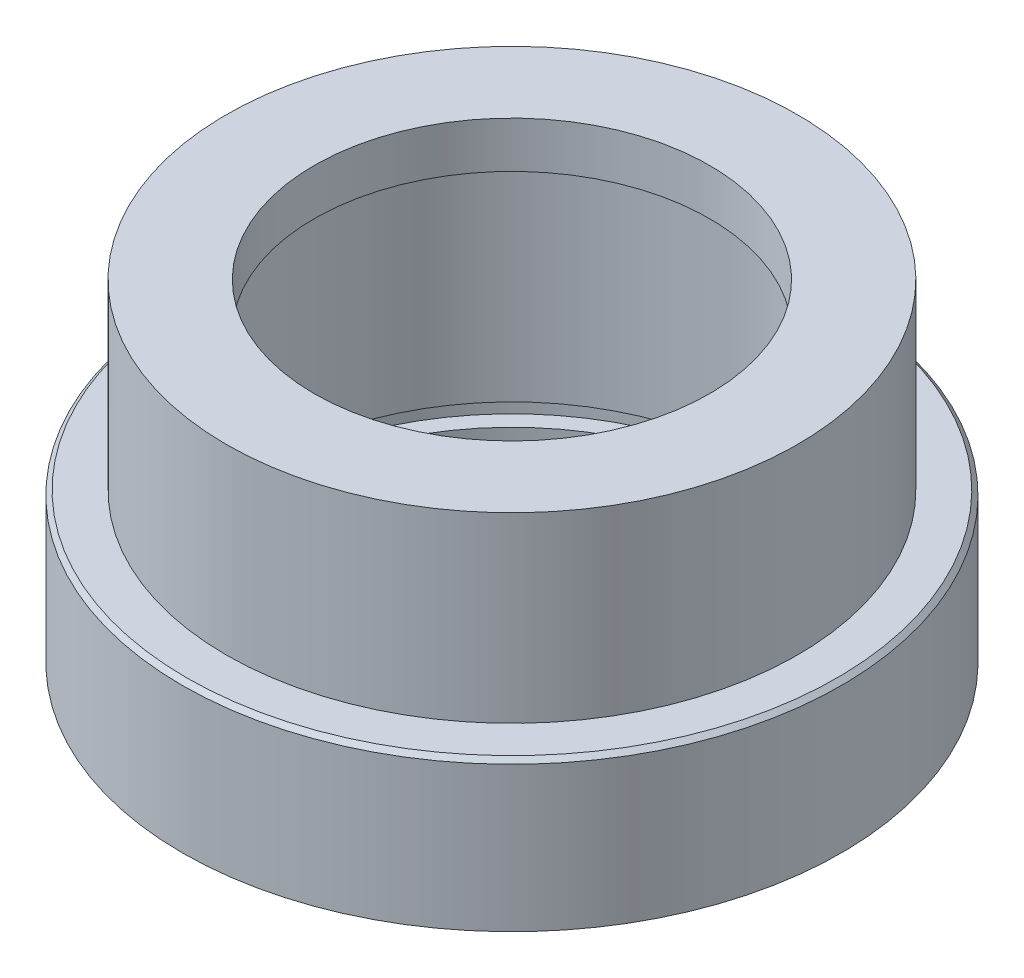
ISO-10303-21;
HEADER;
FILE_DESCRIPTION(('STEP AP214'),'2;1');
FILE_NAME('part.step','',(''),(''),'','','');
FILE_SCHEMA(('AUTOMOTIVE_DESIGN { 1 0 10303 214 1 1 1 1 }'));
ENDSEC;
DATA;
#1=APPLICATION_CONTEXT('core data for automotive mechanical design processes');
#2=APPLICATION_PROTOCOL_DEFINITION('international standard','automotive_design',2000,#1);
#3=PRODUCT_CONTEXT('',#1,'mechanical');
#4=PRODUCT('Part','Part','',(#3));
#5=PRODUCT_RELATED_PRODUCT_CATEGORY('part','',(#4));
#6=PRODUCT_DEFINITION_FORMATION('','',#4);
#7=PRODUCT_DEFINITION_CONTEXT('part definition',#1,'design');
#8=PRODUCT_DEFINITION('design','',#6,#7);
#9=PRODUCT_DEFINITION_SHAPE('','',#8);
#10=(LENGTH_UNIT() NAMED_UNIT(*) SI_UNIT(.MILLI.,.METRE.));
#11=(NAMED_UNIT(*) PLANE_ANGLE_UNIT() SI_UNIT($,.RADIAN.));
#12=(NAMED_UNIT(*) SI_UNIT($,.STERADIAN.) SOLID_ANGLE_UNIT());
#13=UNCERTAINTY_MEASURE_WITH_UNIT(LENGTH_MEASURE(1.E-05),#10,'distance_accuracy_value','');
#14=(GEOMETRIC_REPRESENTATION_CONTEXT(3) GLOBAL_UNCERTAINTY_ASSIGNED_CONTEXT((#13)) GLOBAL_UNIT_ASSIGNED_CONTEXT((#10,
#11,#12)) REPRESENTATION_CONTEXT('',''));
#15=CARTESIAN_POINT('',(0.,0.,0.));
#16=DIRECTION('',(0.,0.,1.));
#17=DIRECTION('',(1.,0.,0.));
#18=AXIS2_PLACEMENT_3D('',#15,#16,#17);
#19=CARTESIAN_POINT('',(0.,0.,0.));
#20=DIRECTION('',(0.,1.,0.));
#21=DIRECTION('',(0.,0.,1.));
#22=AXIS2_PLACEMENT_3D('',#19,#20,#21);
#23=CYLINDRICAL_SURFACE('',#22,9.);
#24=CARTESIAN_POINT('',(0.,7.35,0.));
#25=DIRECTION('',(0.,1.,0.));
#26=DIRECTION('',(0.,0.,1.));
#27=AXIS2_PLACEMENT_3D('',#24,#25,#26);
#28=CIRCLE('',#27,9.);
#29=CARTESIAN_POINT('',(0.,7.35,9.));
#30=VERTEX_POINT('',#29);
#31=EDGE_CURVE('E10',#30,#30,#28,.T.);
#32=ORIENTED_EDGE('',*,*,#31,.T.);
#33=EDGE_LOOP('',(#32));
#34=FACE_BOUND('',#33,.T.);
#35=CARTESIAN_POINT('',(0.,5.25,0.));
#36=DIRECTION('',(0.,1.,0.));
#37=DIRECTION('',(0.,0.,1.));
#38=AXIS2_PLACEMENT_3D('',#35,#36,#37);
#39=CIRCLE('',#38,9.);
#40=CARTESIAN_POINT('',(0.,5.25,9.));
#41=VERTEX_POINT('',#40);
#42=EDGE_CURVE('E82',#41,#41,#39,.T.);
#43=ORIENTED_EDGE('',*,*,#42,.F.);
#44=EDGE_LOOP('',(#43));
#45=FACE_BOUND('',#44,.T.);
#46=ADVANCED_FACE('F39',(#34,#45),#23,.F.);
#47=CARTESIAN_POINT('',(-9.,7.35,0.));
#48=DIRECTION('',(0.,1.,0.));
#49=DIRECTION('',(0.,0.,1.));
#50=AXIS2_PLACEMENT_3D('',#47,#48,#49);
#51=PLANE('',#50);
#52=CARTESIAN_POINT('',(0.,7.35,0.));
#53=DIRECTION('',(0.,1.,0.));
#54=DIRECTION('',(0.,0.,1.));
#55=AXIS2_PLACEMENT_3D('',#52,#53,#54);
#56=CIRCLE('',#55,13.);
#57=CARTESIAN_POINT('',(0.,7.35,13.));
#58=VERTEX_POINT('',#57);
#59=EDGE_CURVE('E45',#58,#58,#56,.T.);
#60=ORIENTED_EDGE('',*,*,#59,.T.);
#61=EDGE_LOOP('',(#60));
#62=FACE_BOUND('',#61,.T.);
#63=ORIENTED_EDGE('',*,*,#31,.F.);
#64=EDGE_LOOP('',(#63));
#65=FACE_BOUND('',#64,.T.);
#66=ADVANCED_FACE('F90',(#62,#65),#51,.T.);
#67=CARTESIAN_POINT('',(0.,0.,0.));
#68=DIRECTION('',(0.,1.,0.));
#69=DIRECTION('',(0.,0.,1.));
#70=AXIS2_PLACEMENT_3D('',#67,#68,#69);
#71=CYLINDRICAL_SURFACE('',#70,13.);
#72=CARTESIAN_POINT('',(0.,-0.95,0.));
#73=DIRECTION('',(0.,1.,0.));
#74=DIRECTION('',(0.,0.,1.));
#75=AXIS2_PLACEMENT_3D('',#72,#73,#74);
#76=CIRCLE('',#75,13.);
#77=CARTESIAN_POINT('',(0.,-0.95,13.));
#78=VERTEX_POINT('',#77);
#79=EDGE_CURVE('E49',#78,#78,#76,.T.);
#80=ORIENTED_EDGE('',*,*,#79,.T.);
#81=EDGE_LOOP('',(#80));
#82=FACE_BOUND('',#81,.T.);
#83=ORIENTED_EDGE('',*,*,#59,.F.);
#84=EDGE_LOOP('',(#83));
#85=FACE_BOUND('',#84,.T.);
#86=ADVANCED_FACE('F94',(#82,#85),#71,.T.);
#87=CARTESIAN_POINT('',(-13.,-0.95,0.));
#88=DIRECTION('',(0.,1.,0.));
#89=DIRECTION('',(0.,0.,1.));
#90=AXIS2_PLACEMENT_3D('',#87,#88,#89);
#91=PLANE('',#90);
#92=CARTESIAN_POINT('',(0.,-0.95,0.));
#93=DIRECTION('',(0.,1.,0.));
#94=DIRECTION('',(0.,0.,1.));
#95=AXIS2_PLACEMENT_3D('',#92,#93,#94);
#96=CIRCLE('',#95,14.8);
#97=CARTESIAN_POINT('',(0.,-0.95,14.8));
#98=VERTEX_POINT('',#97);
#99=EDGE_CURVE('E53',#98,#98,#96,.T.);
#100=ORIENTED_EDGE('',*,*,#99,.T.);
#101=EDGE_LOOP('',(#100));
#102=FACE_BOUND('',#101,.T.);
#103=ORIENTED_EDGE('',*,*,#79,.F.);
#104=EDGE_LOOP('',(#103));
#105=FACE_BOUND('',#104,.T.);
#106=ADVANCED_FACE('F98',(#102,#105),#91,.T.);
#107=CARTESIAN_POINT('',(0.,-0.95,0.));
#108=DIRECTION('',(0.,-1.,0.));
#109=DIRECTION('',(0.,0.,-1.));
#110=AXIS2_PLACEMENT_3D('',#107,#108,#109);
#111=CONICAL_SURFACE('',#110,14.8,0.785398163397449);
#112=CARTESIAN_POINT('',(0.,-1.15,0.));
#113=DIRECTION('',(0.,1.,0.));
#114=DIRECTION('',(0.,0.,1.));
#115=AXIS2_PLACEMENT_3D('',#112,#113,#114);
#116=CIRCLE('',#115,15.);
#117=CARTESIAN_POINT('',(0.,-1.15,15.));
#118=VERTEX_POINT('',#117);
#119=EDGE_CURVE('E58',#118,#118,#116,.T.);
#120=ORIENTED_EDGE('',*,*,#119,.T.);
#121=EDGE_LOOP('',(#120));
#122=FACE_BOUND('',#121,.T.);
#123=ORIENTED_EDGE('',*,*,#99,.F.);
#124=EDGE_LOOP('',(#123));
#125=FACE_BOUND('',#124,.T.);
#126=ADVANCED_FACE('F105',(#122,#125),#111,.T.);
#127=CARTESIAN_POINT('',(0.,0.,0.));
#128=DIRECTION('',(0.,1.,0.));
#129=DIRECTION('',(0.,0.,1.));
#130=AXIS2_PLACEMENT_3D('',#127,#128,#129);
#131=CYLINDRICAL_SURFACE('',#130,15.);
#132=CARTESIAN_POINT('',(0.,-7.75,0.));
#133=DIRECTION('',(0.,1.,0.));
#134=DIRECTION('',(0.,0.,1.));
#135=AXIS2_PLACEMENT_3D('',#132,#133,#134);
#136=CIRCLE('',#135,15.);
#137=CARTESIAN_POINT('',(0.,-7.75,15.));
#138=VERTEX_POINT('',#137);
#139=EDGE_CURVE('E61',#138,#138,#136,.T.);
#140=ORIENTED_EDGE('',*,*,#139,.T.);
#141=EDGE_LOOP('',(#140));
#142=FACE_BOUND('',#141,.T.);
#143=ORIENTED_EDGE('',*,*,#119,.F.);
#144=EDGE_LOOP('',(#143));
#145=FACE_BOUND('',#144,.T.);
#146=ADVANCED_FACE('F109',(#142,#145),#131,.T.);
#147=CARTESIAN_POINT('',(-15.,-7.75,0.));
#148=DIRECTION('',(0.,-1.,0.));
#149=DIRECTION('',(0.,0.,-1.));
#150=AXIS2_PLACEMENT_3D('',#147,#148,#149);
#151=PLANE('',#150);
#152=CARTESIAN_POINT('',(0.,-7.75,0.));
#153=DIRECTION('',(0.,1.,0.));
#154=DIRECTION('',(0.,0.,1.));
#155=AXIS2_PLACEMENT_3D('',#152,#153,#154);
#156=CIRCLE('',#155,11.);
#157=CARTESIAN_POINT('',(0.,-7.75,11.));
#158=VERTEX_POINT('',#157);
#159=EDGE_CURVE('E64',#158,#158,#156,.T.);
#160=ORIENTED_EDGE('',*,*,#159,.T.);
#161=EDGE_LOOP('',(#160));
#162=FACE_BOUND('',#161,.T.);
#163=ORIENTED_EDGE('',*,*,#139,.F.);
#164=EDGE_LOOP('',(#163));
#165=FACE_BOUND('',#164,.T.);
#166=ADVANCED_FACE('F113',(#162,#165),#151,.T.);
#167=CARTESIAN_POINT('',(0.,0.,0.));
#168=DIRECTION('',(0.,1.,0.));
#169=DIRECTION('',(0.,0.,1.));
#170=AXIS2_PLACEMENT_3D('',#167,#168,#169);
#171=CYLINDRICAL_SURFACE('',#170,11.);
#172=CARTESIAN_POINT('',(0.,-6.25,0.));
#173=DIRECTION('',(0.,1.,0.));
#174=DIRECTION('',(0.,0.,1.));
#175=AXIS2_PLACEMENT_3D('',#172,#173,#174);
#176=CIRCLE('',#175,11.);
#177=CARTESIAN_POINT('',(0.,-6.25,11.));
#178=VERTEX_POINT('',#177);
#179=EDGE_CURVE('E67',#178,#178,#176,.T.);
#180=ORIENTED_EDGE('',*,*,#179,.T.);
#181=EDGE_LOOP('',(#180));
#182=FACE_BOUND('',#181,.T.);
#183=ORIENTED_EDGE('',*,*,#159,.F.);
#184=EDGE_LOOP('',(#183));
#185=FACE_BOUND('',#184,.T.);
#186=ADVANCED_FACE('F117',(#182,#185),#171,.F.);
#187=CARTESIAN_POINT('',(-11.,-6.25,0.));
#188=DIRECTION('',(0.,1.,0.));
#189=DIRECTION('',(0.,0.,1.));
#190=AXIS2_PLACEMENT_3D('',#187,#188,#189);
#191=PLANE('',#190);
#192=CARTESIAN_POINT('',(0.,-6.25,0.));
#193=DIRECTION('',(0.,1.,0.));
#194=DIRECTION('',(0.,0.,1.));
#195=AXIS2_PLACEMENT_3D('',#192,#193,#194);
#196=CIRCLE('',#195,11.75);
#197=CARTESIAN_POINT('',(0.,-6.25,11.75));
#198=VERTEX_POINT('',#197);
#199=EDGE_CURVE('E70',#198,#198,#196,.T.);
#200=ORIENTED_EDGE('',*,*,#199,.T.);
#201=EDGE_LOOP('',(#200));
#202=FACE_BOUND('',#201,.T.);
#203=ORIENTED_EDGE('',*,*,#179,.F.);
#204=EDGE_LOOP('',(#203));
#205=FACE_BOUND('',#204,.T.);
#206=ADVANCED_FACE('F121',(#202,#205),#191,.T.);
#207=CARTESIAN_POINT('',(0.,0.,0.));
#208=DIRECTION('',(0.,1.,0.));
#209=DIRECTION('',(0.,0.,1.));
#210=AXIS2_PLACEMENT_3D('',#207,#208,#209);
#211=CYLINDRICAL_SURFACE('',#210,11.75);
#212=CARTESIAN_POINT('',(0.,-5.25,0.));
#213=DIRECTION('',(0.,1.,0.));
#214=DIRECTION('',(0.,0.,1.));
#215=AXIS2_PLACEMENT_3D('',#212,#213,#214);
#216=CIRCLE('',#215,11.75);
#217=CARTESIAN_POINT('',(0.,-5.25,11.75));
#218=VERTEX_POINT('',#217);
#219=EDGE_CURVE('E73',#218,#218,#216,.T.);
#220=ORIENTED_EDGE('',*,*,#219,.T.);
#221=EDGE_LOOP('',(#220));
#222=FACE_BOUND('',#221,.T.);
#223=ORIENTED_EDGE('',*,*,#199,.F.);
#224=EDGE_LOOP('',(#223));
#225=FACE_BOUND('',#224,.T.);
#226=ADVANCED_FACE('F125',(#222,#225),#211,.F.);
#227=CARTESIAN_POINT('',(-11.,-5.25,0.));
#228=DIRECTION('',(0.,-1.,0.));
#229=DIRECTION('',(0.,0.,-1.));
#230=AXIS2_PLACEMENT_3D('',#227,#228,#229);
#231=PLANE('',#230);
#232=CARTESIAN_POINT('',(0.,-5.25,0.));
#233=DIRECTION('',(0.,1.,0.));
#234=DIRECTION('',(0.,0.,1.));
#235=AXIS2_PLACEMENT_3D('',#232,#233,#234);
#236=CIRCLE('',#235,11.);
#237=CARTESIAN_POINT('',(0.,-5.25,11.));
#238=VERTEX_POINT('',#237);
#239=EDGE_CURVE('E76',#238,#238,#236,.T.);
#240=ORIENTED_EDGE('',*,*,#239,.T.);
#241=EDGE_LOOP('',(#240));
#242=FACE_BOUND('',#241,.T.);
#243=ORIENTED_EDGE('',*,*,#219,.F.);
#244=EDGE_LOOP('',(#243));
#245=FACE_BOUND('',#244,.T.);
#246=ADVANCED_FACE('F129',(#242,#245),#231,.T.);
#247=CARTESIAN_POINT('',(0.,0.,0.));
#248=DIRECTION('',(0.,1.,0.));
#249=DIRECTION('',(0.,0.,1.));
#250=AXIS2_PLACEMENT_3D('',#247,#248,#249);
#251=CYLINDRICAL_SURFACE('',#250,11.);
#252=CARTESIAN_POINT('',(0.,5.25,0.));
#253=DIRECTION('',(0.,1.,0.));
#254=DIRECTION('',(0.,0.,1.));
#255=AXIS2_PLACEMENT_3D('',#252,#253,#254);
#256=CIRCLE('',#255,11.);
#257=CARTESIAN_POINT('',(0.,5.25,11.));
#258=VERTEX_POINT('',#257);
#259=EDGE_CURVE('E79',#258,#258,#256,.T.);
#260=ORIENTED_EDGE('',*,*,#259,.T.);
#261=EDGE_LOOP('',(#260));
#262=FACE_BOUND('',#261,.T.);
#263=ORIENTED_EDGE('',*,*,#239,.F.);
#264=EDGE_LOOP('',(#263));
#265=FACE_BOUND('',#264,.T.);
#266=ADVANCED_FACE('F133',(#262,#265),#251,.F.);
#267=CARTESIAN_POINT('',(-11.,5.25,0.));
#268=DIRECTION('',(0.,-1.,0.));
#269=DIRECTION('',(0.,0.,-1.));
#270=AXIS2_PLACEMENT_3D('',#267,#268,#269);
#271=PLANE('',#270);
#272=ORIENTED_EDGE('',*,*,#42,.T.);
#273=EDGE_LOOP('',(#272));
#274=FACE_BOUND('',#273,.T.);
#275=ORIENTED_EDGE('',*,*,#259,.F.);
#276=EDGE_LOOP('',(#275));
#277=FACE_BOUND('',#276,.T.);
#278=ADVANCED_FACE('F86',(#274,#277),#271,.T.);
#279=CLOSED_SHELL('',(#46,#66,#86,#106,#126,#146,#166,#186,#206,#226,#246,#266,#278));
#280=MANIFOLD_SOLID_BREP('B2',#279);
#281=ADVANCED_BREP_SHAPE_REPRESENTATION('',(#18,#280),#14);
#282=SHAPE_DEFINITION_REPRESENTATION(#9,#281);
ENDSEC;
END-ISO-10303-21;
